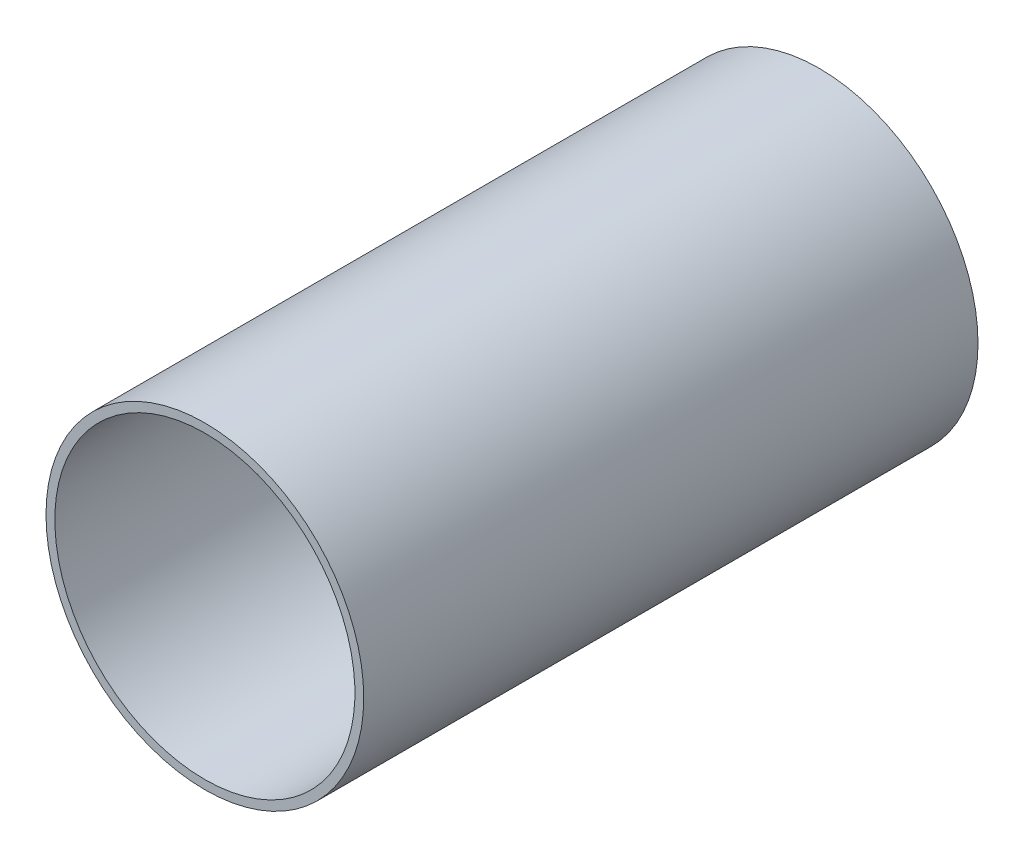
ISO-10303-21;
HEADER;
FILE_DESCRIPTION(('STEP AP214'),'2;1');
FILE_NAME('part.step','',(''),(''),'','','');
FILE_SCHEMA(('AUTOMOTIVE_DESIGN { 1 0 10303 214 1 1 1 1 }'));
ENDSEC;
DATA;
#1=APPLICATION_CONTEXT('core data for automotive mechanical design processes');
#2=APPLICATION_PROTOCOL_DEFINITION('international standard','automotive_design',2000,#1);
#3=PRODUCT_CONTEXT('',#1,'mechanical');
#4=PRODUCT('Part','Part','',(#3));
#5=PRODUCT_RELATED_PRODUCT_CATEGORY('part','',(#4));
#6=PRODUCT_DEFINITION_FORMATION('','',#4);
#7=PRODUCT_DEFINITION_CONTEXT('part definition',#1,'design');
#8=PRODUCT_DEFINITION('design','',#6,#7);
#9=PRODUCT_DEFINITION_SHAPE('','',#8);
#10=(LENGTH_UNIT() NAMED_UNIT(*) SI_UNIT(.MILLI.,.METRE.));
#11=(NAMED_UNIT(*) PLANE_ANGLE_UNIT() SI_UNIT($,.RADIAN.));
#12=(NAMED_UNIT(*) SI_UNIT($,.STERADIAN.) SOLID_ANGLE_UNIT());
#13=UNCERTAINTY_MEASURE_WITH_UNIT(LENGTH_MEASURE(1.E-05),#10,'distance_accuracy_value','');
#14=(GEOMETRIC_REPRESENTATION_CONTEXT(3) GLOBAL_UNCERTAINTY_ASSIGNED_CONTEXT((#13)) GLOBAL_UNIT_ASSIGNED_CONTEXT((#10,
#11,#12)) REPRESENTATION_CONTEXT('',''));
#15=CARTESIAN_POINT('',(0.,0.,0.));
#16=DIRECTION('',(0.,0.,1.));
#17=DIRECTION('',(1.,0.,0.));
#18=AXIS2_PLACEMENT_3D('',#15,#16,#17);
#19=CARTESIAN_POINT('',(118.105,-153.249,-0.045));
#20=DIRECTION('',(0.,0.,-1.));
#21=DIRECTION('',(0.,-1.,0.));
#22=AXIS2_PLACEMENT_3D('',#19,#20,#21);
#23=CYLINDRICAL_SURFACE('',#22,0.425);
#24=CARTESIAN_POINT('',(118.105,-153.249,-0.035));
#25=DIRECTION('',(0.,0.,-1.));
#26=DIRECTION('',(0.,-1.,0.));
#27=AXIS2_PLACEMENT_3D('',#24,#25,#26);
#28=CIRCLE('',#27,0.425);
#29=CARTESIAN_POINT('',(118.105,-153.674,-0.035));
#30=VERTEX_POINT('',#29);
#31=EDGE_CURVE('E65',#30,#30,#28,.T.);
#32=ORIENTED_EDGE('',*,*,#31,.T.);
#33=DIRECTION('',(0.,0.,1.));
#34=VECTOR('',#33,1.);
#35=CARTESIAN_POINT('',(118.105,-153.674,-0.045));
#36=LINE('',#35,#34);
#37=CARTESIAN_POINT('',(118.105,-153.674,1.705));
#38=VERTEX_POINT('',#37);
#39=EDGE_CURVE('E11',#30,#38,#36,.T.);
#40=ORIENTED_EDGE('',*,*,#39,.T.);
#41=CARTESIAN_POINT('',(118.105,-153.249,1.705));
#42=DIRECTION('',(0.,0.,-1.));
#43=DIRECTION('',(0.,-1.,0.));
#44=AXIS2_PLACEMENT_3D('',#41,#42,#43);
#45=CIRCLE('',#44,0.425);
#46=EDGE_CURVE('E26',#38,#38,#45,.T.);
#47=ORIENTED_EDGE('',*,*,#46,.F.);
#48=ORIENTED_EDGE('',*,*,#39,.F.);
#49=EDGE_LOOP('',(#32,#40,#47,#48));
#50=FACE_BOUND('',#49,.T.);
#51=ADVANCED_FACE('F17',(#50),#23,.F.);
#52=CARTESIAN_POINT('',(118.105,-153.699,1.705));
#53=DIRECTION('',(0.,0.,1.));
#54=DIRECTION('',(1.,0.,0.));
#55=AXIS2_PLACEMENT_3D('',#52,#53,#54);
#56=PLANE('',#55);
#57=ORIENTED_EDGE('',*,*,#46,.T.);
#58=EDGE_LOOP('',(#57));
#59=FACE_BOUND('',#58,.T.);
#60=CARTESIAN_POINT('',(118.105,-153.249,1.705));
#61=DIRECTION('',(0.,0.,1.));
#62=DIRECTION('',(0.,-1.,0.));
#63=AXIS2_PLACEMENT_3D('',#60,#61,#62);
#64=CIRCLE('',#63,0.45);
#65=CARTESIAN_POINT('',(118.105,-153.699,1.705));
#66=VERTEX_POINT('',#65);
#67=EDGE_CURVE('E57',#66,#66,#64,.T.);
#68=ORIENTED_EDGE('',*,*,#67,.T.);
#69=EDGE_LOOP('',(#68));
#70=FACE_BOUND('',#69,.T.);
#71=ADVANCED_FACE('F19',(#59,#70),#56,.T.);
#72=CARTESIAN_POINT('',(118.105,-153.699,-0.035));
#73=DIRECTION('',(0.,0.,1.));
#74=DIRECTION('',(1.,0.,0.));
#75=AXIS2_PLACEMENT_3D('',#72,#73,#74);
#76=PLANE('',#75);
#77=ORIENTED_EDGE('',*,*,#31,.F.);
#78=EDGE_LOOP('',(#77));
#79=FACE_BOUND('',#78,.T.);
#80=CARTESIAN_POINT('',(118.105,-153.249,-0.035));
#81=DIRECTION('',(0.,0.,1.));
#82=DIRECTION('',(0.,-1.,0.));
#83=AXIS2_PLACEMENT_3D('',#80,#81,#82);
#84=CIRCLE('',#83,0.45);
#85=CARTESIAN_POINT('',(118.105,-153.699,-0.035));
#86=VERTEX_POINT('',#85);
#87=EDGE_CURVE('E56',#86,#86,#84,.T.);
#88=ORIENTED_EDGE('',*,*,#87,.F.);
#89=EDGE_LOOP('',(#88));
#90=FACE_BOUND('',#89,.T.);
#91=ADVANCED_FACE('F75',(#79,#90),#76,.F.);
#92=CARTESIAN_POINT('',(118.105,-153.249,-0.035));
#93=DIRECTION('',(0.,0.,-1.));
#94=DIRECTION('',(0.,-1.,0.));
#95=AXIS2_PLACEMENT_3D('',#92,#93,#94);
#96=CYLINDRICAL_SURFACE('',#95,0.45);
#97=ORIENTED_EDGE('',*,*,#87,.T.);
#98=DIRECTION('',(0.,0.,1.));
#99=VECTOR('',#98,1.);
#100=CARTESIAN_POINT('',(118.105,-153.699,-0.035));
#101=LINE('',#100,#99);
#102=EDGE_CURVE('E53',#86,#66,#101,.T.);
#103=ORIENTED_EDGE('',*,*,#102,.T.);
#104=ORIENTED_EDGE('',*,*,#67,.F.);
#105=ORIENTED_EDGE('',*,*,#102,.F.);
#106=EDGE_LOOP('',(#97,#103,#104,#105));
#107=FACE_BOUND('',#106,.T.);
#108=ADVANCED_FACE('F54',(#107),#96,.T.);
#109=CLOSED_SHELL('',(#51,#71,#91,#108));
#110=MANIFOLD_SOLID_BREP('B1',#109);
#111=ADVANCED_BREP_SHAPE_REPRESENTATION('',(#18,#110),#14);
#112=SHAPE_DEFINITION_REPRESENTATION(#9,#111);
ENDSEC;
END-ISO-10303-21;
